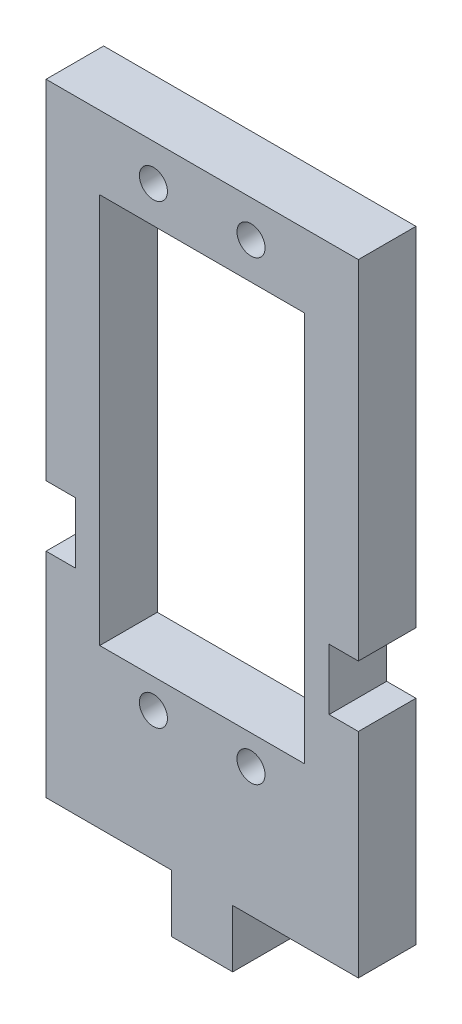
ISO-10303-21;
HEADER;
FILE_DESCRIPTION(('STEP AP214'),'2;1');
FILE_NAME('part.step','',(''),(''),'','','');
FILE_SCHEMA(('AUTOMOTIVE_DESIGN { 1 0 10303 214 1 1 1 1 }'));
ENDSEC;
DATA;
#1=APPLICATION_CONTEXT('core data for automotive mechanical design processes');
#2=APPLICATION_PROTOCOL_DEFINITION('international standard','automotive_design',2000,#1);
#3=PRODUCT_CONTEXT('',#1,'mechanical');
#4=PRODUCT('Part','Part','',(#3));
#5=PRODUCT_RELATED_PRODUCT_CATEGORY('part','',(#4));
#6=PRODUCT_DEFINITION_FORMATION('','',#4);
#7=PRODUCT_DEFINITION_CONTEXT('part definition',#1,'design');
#8=PRODUCT_DEFINITION('design','',#6,#7);
#9=PRODUCT_DEFINITION_SHAPE('','',#8);
#10=(LENGTH_UNIT() NAMED_UNIT(*) SI_UNIT(.MILLI.,.METRE.));
#11=(NAMED_UNIT(*) PLANE_ANGLE_UNIT() SI_UNIT($,.RADIAN.));
#12=(NAMED_UNIT(*) SI_UNIT($,.STERADIAN.) SOLID_ANGLE_UNIT());
#13=UNCERTAINTY_MEASURE_WITH_UNIT(LENGTH_MEASURE(1.E-05),#10,'distance_accuracy_value','');
#14=(GEOMETRIC_REPRESENTATION_CONTEXT(3) GLOBAL_UNCERTAINTY_ASSIGNED_CONTEXT((#13)) GLOBAL_UNIT_ASSIGNED_CONTEXT((#10,
#11,#12)) REPRESENTATION_CONTEXT('',''));
#15=CARTESIAN_POINT('',(0.,0.,0.));
#16=DIRECTION('',(0.,0.,1.));
#17=DIRECTION('',(1.,0.,0.));
#18=AXIS2_PLACEMENT_3D('',#15,#16,#17);
#19=CARTESIAN_POINT('',(0.,0.,5.9944));
#20=DIRECTION('',(0.,0.,1.));
#21=DIRECTION('',(1.,0.,0.));
#22=AXIS2_PLACEMENT_3D('',#19,#20,#21);
#23=PLANE('',#22);
#24=CARTESIAN_POINT('',(-5.08,13.462,5.9944));
#25=DIRECTION('',(0.,0.,1.));
#26=DIRECTION('',(-1.,0.,0.));
#27=AXIS2_PLACEMENT_3D('',#24,#25,#26);
#28=CIRCLE('',#27,1.4605);
#29=CARTESIAN_POINT('',(-6.5405,13.462,5.9944));
#30=VERTEX_POINT('',#29);
#31=EDGE_CURVE('E629',#30,#30,#28,.T.);
#32=ORIENTED_EDGE('',*,*,#31,.F.);
#33=EDGE_LOOP('',(#32));
#34=FACE_BOUND('',#33,.T.);
#35=CARTESIAN_POINT('',(5.08,60.96,5.9944));
#36=DIRECTION('',(0.,0.,1.));
#37=DIRECTION('',(1.,0.,0.));
#38=AXIS2_PLACEMENT_3D('',#35,#36,#37);
#39=CIRCLE('',#38,1.4605);
#40=CARTESIAN_POINT('',(6.5405,60.96,5.9944));
#41=VERTEX_POINT('',#40);
#42=EDGE_CURVE('E199',#41,#41,#39,.T.);
#43=ORIENTED_EDGE('',*,*,#42,.F.);
#44=EDGE_LOOP('',(#43));
#45=FACE_BOUND('',#44,.T.);
#46=DIRECTION('',(0.,-1.,0.));
#47=VECTOR('',#46,1.);
#48=CARTESIAN_POINT('',(-16.256,28.575,5.9944));
#49=LINE('',#48,#47);
#50=CARTESIAN_POINT('',(-16.256,64.77,5.9944));
#51=VERTEX_POINT('',#50);
#52=CARTESIAN_POINT('',(-16.256,28.575,5.9944));
#53=VERTEX_POINT('',#52);
#54=EDGE_CURVE('E209',#51,#53,#49,.T.);
#55=ORIENTED_EDGE('',*,*,#54,.T.);
#56=DIRECTION('',(1.,0.,0.));
#57=VECTOR('',#56,1.);
#58=CARTESIAN_POINT('',(-16.256,28.575,5.9944));
#59=LINE('',#58,#57);
#60=CARTESIAN_POINT('',(-13.208,28.575,5.9944));
#61=VERTEX_POINT('',#60);
#62=EDGE_CURVE('E212',#53,#61,#59,.T.);
#63=ORIENTED_EDGE('',*,*,#62,.T.);
#64=DIRECTION('',(0.,-1.,0.));
#65=VECTOR('',#64,1.);
#66=CARTESIAN_POINT('',(-13.208,28.575,5.9944));
#67=LINE('',#66,#65);
#68=CARTESIAN_POINT('',(-13.208,22.225,5.9944));
#69=VERTEX_POINT('',#68);
#70=EDGE_CURVE('E215',#61,#69,#67,.T.);
#71=ORIENTED_EDGE('',*,*,#70,.T.);
#72=DIRECTION('',(-1.,0.,0.));
#73=VECTOR('',#72,1.);
#74=CARTESIAN_POINT('',(-13.208,22.225,5.9944));
#75=LINE('',#74,#73);
#76=CARTESIAN_POINT('',(-16.256,22.225,5.9944));
#77=VERTEX_POINT('',#76);
#78=EDGE_CURVE('E217',#69,#77,#75,.T.);
#79=ORIENTED_EDGE('',*,*,#78,.T.);
#80=DIRECTION('',(0.,-1.,0.));
#81=VECTOR('',#80,1.);
#82=CARTESIAN_POINT('',(-16.256,0.,5.9944));
#83=LINE('',#82,#81);
#84=CARTESIAN_POINT('',(-16.256,0.,5.9944));
#85=VERTEX_POINT('',#84);
#86=EDGE_CURVE('E219',#77,#85,#83,.T.);
#87=ORIENTED_EDGE('',*,*,#86,.T.);
#88=DIRECTION('',(1.,0.,0.));
#89=VECTOR('',#88,1.);
#90=CARTESIAN_POINT('',(-3.175,0.,5.9944));
#91=LINE('',#90,#89);
#92=CARTESIAN_POINT('',(-3.175,0.,5.9944));
#93=VERTEX_POINT('',#92);
#94=EDGE_CURVE('E221',#85,#93,#91,.T.);
#95=ORIENTED_EDGE('',*,*,#94,.T.);
#96=DIRECTION('',(0.,-1.,0.));
#97=VECTOR('',#96,1.);
#98=CARTESIAN_POINT('',(-3.175,-5.9944,5.9944));
#99=LINE('',#98,#97);
#100=CARTESIAN_POINT('',(-3.175,-5.9944,5.9944));
#101=VERTEX_POINT('',#100);
#102=EDGE_CURVE('E223',#93,#101,#99,.T.);
#103=ORIENTED_EDGE('',*,*,#102,.T.);
#104=DIRECTION('',(1.,0.,0.));
#105=VECTOR('',#104,1.);
#106=CARTESIAN_POINT('',(-3.175,-5.9944,5.9944));
#107=LINE('',#106,#105);
#108=CARTESIAN_POINT('',(3.175,-5.9944,5.9944));
#109=VERTEX_POINT('',#108);
#110=EDGE_CURVE('E225',#101,#109,#107,.T.);
#111=ORIENTED_EDGE('',*,*,#110,.T.);
#112=DIRECTION('',(0.,1.,0.));
#113=VECTOR('',#112,1.);
#114=CARTESIAN_POINT('',(3.175,-5.9944,5.9944));
#115=LINE('',#114,#113);
#116=CARTESIAN_POINT('',(3.175,0.,5.9944));
#117=VERTEX_POINT('',#116);
#118=EDGE_CURVE('E227',#109,#117,#115,.T.);
#119=ORIENTED_EDGE('',*,*,#118,.T.);
#120=DIRECTION('',(1.,0.,0.));
#121=VECTOR('',#120,1.);
#122=CARTESIAN_POINT('',(3.175,0.,5.9944));
#123=LINE('',#122,#121);
#124=CARTESIAN_POINT('',(16.256,0.,5.9944));
#125=VERTEX_POINT('',#124);
#126=EDGE_CURVE('E229',#117,#125,#123,.T.);
#127=ORIENTED_EDGE('',*,*,#126,.T.);
#128=DIRECTION('',(0.,1.,0.));
#129=VECTOR('',#128,1.);
#130=CARTESIAN_POINT('',(16.256,0.,5.9944));
#131=LINE('',#130,#129);
#132=CARTESIAN_POINT('',(16.256,22.225,5.9944));
#133=VERTEX_POINT('',#132);
#134=EDGE_CURVE('E231',#125,#133,#131,.T.);
#135=ORIENTED_EDGE('',*,*,#134,.T.);
#136=DIRECTION('',(-1.,0.,0.));
#137=VECTOR('',#136,1.);
#138=CARTESIAN_POINT('',(13.208,22.225,5.9944));
#139=LINE('',#138,#137);
#140=CARTESIAN_POINT('',(13.208,22.225,5.9944));
#141=VERTEX_POINT('',#140);
#142=EDGE_CURVE('E233',#133,#141,#139,.T.);
#143=ORIENTED_EDGE('',*,*,#142,.T.);
#144=DIRECTION('',(0.,1.,0.));
#145=VECTOR('',#144,1.);
#146=CARTESIAN_POINT('',(13.208,28.575,5.9944));
#147=LINE('',#146,#145);
#148=CARTESIAN_POINT('',(13.208,28.575,5.9944));
#149=VERTEX_POINT('',#148);
#150=EDGE_CURVE('E235',#141,#149,#147,.T.);
#151=ORIENTED_EDGE('',*,*,#150,.T.);
#152=DIRECTION('',(1.,0.,0.));
#153=VECTOR('',#152,1.);
#154=CARTESIAN_POINT('',(16.256,28.575,5.9944));
#155=LINE('',#154,#153);
#156=CARTESIAN_POINT('',(16.256,28.575,5.9944));
#157=VERTEX_POINT('',#156);
#158=EDGE_CURVE('E237',#149,#157,#155,.T.);
#159=ORIENTED_EDGE('',*,*,#158,.T.);
#160=DIRECTION('',(0.,1.,0.));
#161=VECTOR('',#160,1.);
#162=CARTESIAN_POINT('',(16.256,28.575,5.9944));
#163=LINE('',#162,#161);
#164=CARTESIAN_POINT('',(16.256,64.77,5.9944));
#165=VERTEX_POINT('',#164);
#166=EDGE_CURVE('E239',#157,#165,#163,.T.);
#167=ORIENTED_EDGE('',*,*,#166,.T.);
#168=DIRECTION('',(-1.,0.,0.));
#169=VECTOR('',#168,1.);
#170=CARTESIAN_POINT('',(16.256,64.77,5.9944));
#171=LINE('',#170,#169);
#172=EDGE_CURVE('E241',#165,#51,#171,.T.);
#173=ORIENTED_EDGE('',*,*,#172,.T.);
#174=EDGE_LOOP('',(#55,#63,#71,#79,#87,#95,#103,#111,#119,#127,#135,#143,#151,#159,#167,#173));
#175=FACE_BOUND('',#174,.T.);
#176=DIRECTION('',(-1.,0.,0.));
#177=VECTOR('',#176,1.);
#178=CARTESIAN_POINT('',(10.668,57.15,5.9944));
#179=LINE('',#178,#177);
#180=CARTESIAN_POINT('',(10.668,57.15,5.9944));
#181=VERTEX_POINT('',#180);
#182=CARTESIAN_POINT('',(-10.668,57.15,5.9944));
#183=VERTEX_POINT('',#182);
#184=EDGE_CURVE('E178',#181,#183,#179,.T.);
#185=ORIENTED_EDGE('',*,*,#184,.F.);
#186=DIRECTION('',(0.,1.,0.));
#187=VECTOR('',#186,1.);
#188=CARTESIAN_POINT('',(10.668,16.51,5.9944));
#189=LINE('',#188,#187);
#190=CARTESIAN_POINT('',(10.668,16.51,5.9944));
#191=VERTEX_POINT('',#190);
#192=EDGE_CURVE('E170',#191,#181,#189,.T.);
#193=ORIENTED_EDGE('',*,*,#192,.F.);
#194=DIRECTION('',(1.,0.,0.));
#195=VECTOR('',#194,1.);
#196=CARTESIAN_POINT('',(-10.668,16.51,5.9944));
#197=LINE('',#196,#195);
#198=CARTESIAN_POINT('',(-10.668,16.51,5.9944));
#199=VERTEX_POINT('',#198);
#200=EDGE_CURVE('E193',#199,#191,#197,.T.);
#201=ORIENTED_EDGE('',*,*,#200,.F.);
#202=DIRECTION('',(0.,-1.,0.));
#203=VECTOR('',#202,1.);
#204=CARTESIAN_POINT('',(-10.668,16.51,5.9944));
#205=LINE('',#204,#203);
#206=EDGE_CURVE('E191',#183,#199,#205,.T.);
#207=ORIENTED_EDGE('',*,*,#206,.F.);
#208=EDGE_LOOP('',(#185,#193,#201,#207));
#209=FACE_BOUND('',#208,.T.);
#210=CARTESIAN_POINT('',(5.08,13.462,5.9944));
#211=DIRECTION('',(0.,0.,1.));
#212=DIRECTION('',(1.,0.,0.));
#213=AXIS2_PLACEMENT_3D('',#210,#211,#212);
#214=CIRCLE('',#213,1.4605);
#215=CARTESIAN_POINT('',(6.5405,13.462,5.9944));
#216=VERTEX_POINT('',#215);
#217=EDGE_CURVE('E635',#216,#216,#214,.T.);
#218=ORIENTED_EDGE('',*,*,#217,.F.);
#219=EDGE_LOOP('',(#218));
#220=FACE_BOUND('',#219,.T.);
#221=CARTESIAN_POINT('',(-5.08,60.96,5.9944));
#222=DIRECTION('',(0.,0.,1.));
#223=DIRECTION('',(-1.,0.,0.));
#224=AXIS2_PLACEMENT_3D('',#221,#222,#223);
#225=CIRCLE('',#224,1.4605);
#226=CARTESIAN_POINT('',(-6.5405,60.96,5.9944));
#227=VERTEX_POINT('',#226);
#228=EDGE_CURVE('E620',#227,#227,#225,.T.);
#229=ORIENTED_EDGE('',*,*,#228,.F.);
#230=EDGE_LOOP('',(#229));
#231=FACE_BOUND('',#230,.T.);
#232=ADVANCED_FACE('F33',(#34,#45,#175,#209,#220,#231),#23,.T.);
#233=CARTESIAN_POINT('',(0.,0.,0.));
#234=DIRECTION('',(0.,0.,1.));
#235=DIRECTION('',(1.,0.,0.));
#236=AXIS2_PLACEMENT_3D('',#233,#234,#235);
#237=PLANE('',#236);
#238=DIRECTION('',(0.,-1.,0.));
#239=VECTOR('',#238,1.);
#240=CARTESIAN_POINT('',(-16.256,28.575,0.));
#241=LINE('',#240,#239);
#242=CARTESIAN_POINT('',(-16.256,64.77,0.));
#243=VERTEX_POINT('',#242);
#244=CARTESIAN_POINT('',(-16.256,28.575,0.));
#245=VERTEX_POINT('',#244);
#246=EDGE_CURVE('E186',#243,#245,#241,.T.);
#247=ORIENTED_EDGE('',*,*,#246,.F.);
#248=DIRECTION('',(-1.,0.,0.));
#249=VECTOR('',#248,1.);
#250=CARTESIAN_POINT('',(16.256,64.77,0.));
#251=LINE('',#250,#249);
#252=CARTESIAN_POINT('',(16.256,64.77,0.));
#253=VERTEX_POINT('',#252);
#254=EDGE_CURVE('E213',#253,#243,#251,.T.);
#255=ORIENTED_EDGE('',*,*,#254,.F.);
#256=DIRECTION('',(0.,1.,0.));
#257=VECTOR('',#256,1.);
#258=CARTESIAN_POINT('',(16.256,28.575,0.));
#259=LINE('',#258,#257);
#260=CARTESIAN_POINT('',(16.256,28.575,0.));
#261=VERTEX_POINT('',#260);
#262=EDGE_CURVE('E272',#261,#253,#259,.T.);
#263=ORIENTED_EDGE('',*,*,#262,.F.);
#264=DIRECTION('',(1.,0.,0.));
#265=VECTOR('',#264,1.);
#266=CARTESIAN_POINT('',(16.256,28.575,0.));
#267=LINE('',#266,#265);
#268=CARTESIAN_POINT('',(13.208,28.575,0.));
#269=VERTEX_POINT('',#268);
#270=EDGE_CURVE('E270',#269,#261,#267,.T.);
#271=ORIENTED_EDGE('',*,*,#270,.F.);
#272=DIRECTION('',(0.,1.,0.));
#273=VECTOR('',#272,1.);
#274=CARTESIAN_POINT('',(13.208,28.575,0.));
#275=LINE('',#274,#273);
#276=CARTESIAN_POINT('',(13.208,22.225,0.));
#277=VERTEX_POINT('',#276);
#278=EDGE_CURVE('E268',#277,#269,#275,.T.);
#279=ORIENTED_EDGE('',*,*,#278,.F.);
#280=DIRECTION('',(-1.,0.,0.));
#281=VECTOR('',#280,1.);
#282=CARTESIAN_POINT('',(13.208,22.225,0.));
#283=LINE('',#282,#281);
#284=CARTESIAN_POINT('',(16.256,22.225,0.));
#285=VERTEX_POINT('',#284);
#286=EDGE_CURVE('E266',#285,#277,#283,.T.);
#287=ORIENTED_EDGE('',*,*,#286,.F.);
#288=DIRECTION('',(0.,1.,0.));
#289=VECTOR('',#288,1.);
#290=CARTESIAN_POINT('',(16.256,0.,0.));
#291=LINE('',#290,#289);
#292=CARTESIAN_POINT('',(16.256,0.,0.));
#293=VERTEX_POINT('',#292);
#294=EDGE_CURVE('E264',#293,#285,#291,.T.);
#295=ORIENTED_EDGE('',*,*,#294,.F.);
#296=DIRECTION('',(1.,0.,0.));
#297=VECTOR('',#296,1.);
#298=CARTESIAN_POINT('',(3.175,0.,0.));
#299=LINE('',#298,#297);
#300=CARTESIAN_POINT('',(3.175,0.,0.));
#301=VERTEX_POINT('',#300);
#302=EDGE_CURVE('E262',#301,#293,#299,.T.);
#303=ORIENTED_EDGE('',*,*,#302,.F.);
#304=DIRECTION('',(0.,1.,0.));
#305=VECTOR('',#304,1.);
#306=CARTESIAN_POINT('',(3.175,-5.9944,0.));
#307=LINE('',#306,#305);
#308=CARTESIAN_POINT('',(3.175,-5.9944,0.));
#309=VERTEX_POINT('',#308);
#310=EDGE_CURVE('E260',#309,#301,#307,.T.);
#311=ORIENTED_EDGE('',*,*,#310,.F.);
#312=DIRECTION('',(1.,0.,0.));
#313=VECTOR('',#312,1.);
#314=CARTESIAN_POINT('',(-3.175,-5.9944,0.));
#315=LINE('',#314,#313);
#316=CARTESIAN_POINT('',(-3.175,-5.9944,0.));
#317=VERTEX_POINT('',#316);
#318=EDGE_CURVE('E258',#317,#309,#315,.T.);
#319=ORIENTED_EDGE('',*,*,#318,.F.);
#320=DIRECTION('',(0.,-1.,0.));
#321=VECTOR('',#320,1.);
#322=CARTESIAN_POINT('',(-3.175,-5.9944,0.));
#323=LINE('',#322,#321);
#324=CARTESIAN_POINT('',(-3.175,0.,0.));
#325=VERTEX_POINT('',#324);
#326=EDGE_CURVE('E256',#325,#317,#323,.T.);
#327=ORIENTED_EDGE('',*,*,#326,.F.);
#328=DIRECTION('',(1.,0.,0.));
#329=VECTOR('',#328,1.);
#330=CARTESIAN_POINT('',(-3.175,0.,0.));
#331=LINE('',#330,#329);
#332=CARTESIAN_POINT('',(-16.256,0.,0.));
#333=VERTEX_POINT('',#332);
#334=EDGE_CURVE('E254',#333,#325,#331,.T.);
#335=ORIENTED_EDGE('',*,*,#334,.F.);
#336=DIRECTION('',(0.,-1.,0.));
#337=VECTOR('',#336,1.);
#338=CARTESIAN_POINT('',(-16.256,0.,0.));
#339=LINE('',#338,#337);
#340=CARTESIAN_POINT('',(-16.256,22.225,0.));
#341=VERTEX_POINT('',#340);
#342=EDGE_CURVE('E252',#341,#333,#339,.T.);
#343=ORIENTED_EDGE('',*,*,#342,.F.);
#344=DIRECTION('',(-1.,0.,0.));
#345=VECTOR('',#344,1.);
#346=CARTESIAN_POINT('',(-13.208,22.225,0.));
#347=LINE('',#346,#345);
#348=CARTESIAN_POINT('',(-13.208,22.225,0.));
#349=VERTEX_POINT('',#348);
#350=EDGE_CURVE('E250',#349,#341,#347,.T.);
#351=ORIENTED_EDGE('',*,*,#350,.F.);
#352=DIRECTION('',(0.,-1.,0.));
#353=VECTOR('',#352,1.);
#354=CARTESIAN_POINT('',(-13.208,28.575,0.));
#355=LINE('',#354,#353);
#356=CARTESIAN_POINT('',(-13.208,28.575,0.));
#357=VERTEX_POINT('',#356);
#358=EDGE_CURVE('E248',#357,#349,#355,.T.);
#359=ORIENTED_EDGE('',*,*,#358,.F.);
#360=DIRECTION('',(1.,0.,0.));
#361=VECTOR('',#360,1.);
#362=CARTESIAN_POINT('',(-16.256,28.575,0.));
#363=LINE('',#362,#361);
#364=EDGE_CURVE('E246',#245,#357,#363,.T.);
#365=ORIENTED_EDGE('',*,*,#364,.F.);
#366=EDGE_LOOP('',(#247,#255,#263,#271,#279,#287,#295,#303,#311,#319,#327,#335,#343,#351,#359,#365));
#367=FACE_BOUND('',#366,.T.);
#368=DIRECTION('',(0.,1.,0.));
#369=VECTOR('',#368,1.);
#370=CARTESIAN_POINT('',(10.668,16.51,0.));
#371=LINE('',#370,#369);
#372=CARTESIAN_POINT('',(10.668,16.51,0.));
#373=VERTEX_POINT('',#372);
#374=CARTESIAN_POINT('',(10.668,57.15,0.));
#375=VERTEX_POINT('',#374);
#376=EDGE_CURVE('E56',#373,#375,#371,.T.);
#377=ORIENTED_EDGE('',*,*,#376,.T.);
#378=DIRECTION('',(-1.,0.,0.));
#379=VECTOR('',#378,1.);
#380=CARTESIAN_POINT('',(10.668,57.15,0.));
#381=LINE('',#380,#379);
#382=CARTESIAN_POINT('',(-10.668,57.15,0.));
#383=VERTEX_POINT('',#382);
#384=EDGE_CURVE('E185',#375,#383,#381,.T.);
#385=ORIENTED_EDGE('',*,*,#384,.T.);
#386=DIRECTION('',(0.,-1.,0.));
#387=VECTOR('',#386,1.);
#388=CARTESIAN_POINT('',(-10.668,16.51,0.));
#389=LINE('',#388,#387);
#390=CARTESIAN_POINT('',(-10.668,16.51,0.));
#391=VERTEX_POINT('',#390);
#392=EDGE_CURVE('E201',#383,#391,#389,.T.);
#393=ORIENTED_EDGE('',*,*,#392,.T.);
#394=DIRECTION('',(1.,0.,0.));
#395=VECTOR('',#394,1.);
#396=CARTESIAN_POINT('',(-10.668,16.51,0.));
#397=LINE('',#396,#395);
#398=EDGE_CURVE('E179',#391,#373,#397,.T.);
#399=ORIENTED_EDGE('',*,*,#398,.T.);
#400=EDGE_LOOP('',(#377,#385,#393,#399));
#401=FACE_BOUND('',#400,.T.);
#402=CARTESIAN_POINT('',(5.08,60.96,0.));
#403=DIRECTION('',(0.,0.,1.));
#404=DIRECTION('',(1.,0.,0.));
#405=AXIS2_PLACEMENT_3D('',#402,#403,#404);
#406=CIRCLE('',#405,1.4605);
#407=CARTESIAN_POINT('',(6.5405,60.96,0.));
#408=VERTEX_POINT('',#407);
#409=EDGE_CURVE('E638',#408,#408,#406,.T.);
#410=ORIENTED_EDGE('',*,*,#409,.T.);
#411=EDGE_LOOP('',(#410));
#412=FACE_BOUND('',#411,.T.);
#413=CARTESIAN_POINT('',(5.08,13.462,0.));
#414=DIRECTION('',(0.,0.,1.));
#415=DIRECTION('',(1.,0.,0.));
#416=AXIS2_PLACEMENT_3D('',#413,#414,#415);
#417=CIRCLE('',#416,1.4605);
#418=CARTESIAN_POINT('',(6.5405,13.462,0.));
#419=VERTEX_POINT('',#418);
#420=EDGE_CURVE('E632',#419,#419,#417,.T.);
#421=ORIENTED_EDGE('',*,*,#420,.T.);
#422=EDGE_LOOP('',(#421));
#423=FACE_BOUND('',#422,.T.);
#424=CARTESIAN_POINT('',(-5.08,13.462,0.));
#425=DIRECTION('',(0.,0.,1.));
#426=DIRECTION('',(-1.,0.,0.));
#427=AXIS2_PLACEMENT_3D('',#424,#425,#426);
#428=CIRCLE('',#427,1.4605);
#429=CARTESIAN_POINT('',(-6.5405,13.462,0.));
#430=VERTEX_POINT('',#429);
#431=EDGE_CURVE('E626',#430,#430,#428,.T.);
#432=ORIENTED_EDGE('',*,*,#431,.T.);
#433=EDGE_LOOP('',(#432));
#434=FACE_BOUND('',#433,.T.);
#435=CARTESIAN_POINT('',(-5.08,60.96,0.));
#436=DIRECTION('',(0.,0.,1.));
#437=DIRECTION('',(-1.,0.,0.));
#438=AXIS2_PLACEMENT_3D('',#435,#436,#437);
#439=CIRCLE('',#438,1.4605);
#440=CARTESIAN_POINT('',(-6.5405,60.96,0.));
#441=VERTEX_POINT('',#440);
#442=EDGE_CURVE('E623',#441,#441,#439,.T.);
#443=ORIENTED_EDGE('',*,*,#442,.T.);
#444=EDGE_LOOP('',(#443));
#445=FACE_BOUND('',#444,.T.);
#446=ADVANCED_FACE('F326',(#367,#401,#412,#423,#434,#445),#237,.F.);
#447=CARTESIAN_POINT('',(-16.256,28.575,5.9944));
#448=DIRECTION('',(1.,0.,0.));
#449=DIRECTION('',(0.,1.,0.));
#450=AXIS2_PLACEMENT_3D('',#447,#448,#449);
#451=PLANE('',#450);
#452=ORIENTED_EDGE('',*,*,#246,.T.);
#453=DIRECTION('',(0.,0.,-1.));
#454=VECTOR('',#453,1.);
#455=CARTESIAN_POINT('',(-16.256,28.575,5.9944));
#456=LINE('',#455,#454);
#457=EDGE_CURVE('E11',#53,#245,#456,.T.);
#458=ORIENTED_EDGE('',*,*,#457,.F.);
#459=ORIENTED_EDGE('',*,*,#54,.F.);
#460=DIRECTION('',(0.,0.,-1.));
#461=VECTOR('',#460,1.);
#462=CARTESIAN_POINT('',(-16.256,64.77,5.9944));
#463=LINE('',#462,#461);
#464=EDGE_CURVE('E243',#51,#243,#463,.T.);
#465=ORIENTED_EDGE('',*,*,#464,.T.);
#466=EDGE_LOOP('',(#452,#458,#459,#465));
#467=FACE_BOUND('',#466,.T.);
#468=ADVANCED_FACE('F35',(#467),#451,.F.);
#469=CARTESIAN_POINT('',(-16.256,28.575,5.9944));
#470=DIRECTION('',(0.,1.,0.));
#471=DIRECTION('',(0.,0.,1.));
#472=AXIS2_PLACEMENT_3D('',#469,#470,#471);
#473=PLANE('',#472);
#474=ORIENTED_EDGE('',*,*,#364,.T.);
#475=DIRECTION('',(0.,0.,-1.));
#476=VECTOR('',#475,1.);
#477=CARTESIAN_POINT('',(-13.208,28.575,5.9944));
#478=LINE('',#477,#476);
#479=EDGE_CURVE('E41',#61,#357,#478,.T.);
#480=ORIENTED_EDGE('',*,*,#479,.F.);
#481=ORIENTED_EDGE('',*,*,#62,.F.);
#482=ORIENTED_EDGE('',*,*,#457,.T.);
#483=EDGE_LOOP('',(#474,#480,#481,#482));
#484=FACE_BOUND('',#483,.T.);
#485=ADVANCED_FACE('F343',(#484),#473,.F.);
#486=CARTESIAN_POINT('',(-13.208,28.575,5.9944));
#487=DIRECTION('',(1.,0.,0.));
#488=DIRECTION('',(0.,0.,-1.));
#489=AXIS2_PLACEMENT_3D('',#486,#487,#488);
#490=PLANE('',#489);
#491=ORIENTED_EDGE('',*,*,#358,.T.);
#492=DIRECTION('',(0.,0.,-1.));
#493=VECTOR('',#492,1.);
#494=CARTESIAN_POINT('',(-13.208,22.225,5.9944));
#495=LINE('',#494,#493);
#496=EDGE_CURVE('E313',#69,#349,#495,.T.);
#497=ORIENTED_EDGE('',*,*,#496,.F.);
#498=ORIENTED_EDGE('',*,*,#70,.F.);
#499=ORIENTED_EDGE('',*,*,#479,.T.);
#500=EDGE_LOOP('',(#491,#497,#498,#499));
#501=FACE_BOUND('',#500,.T.);
#502=ADVANCED_FACE('F320',(#501),#490,.F.);
#503=CARTESIAN_POINT('',(-13.208,22.225,5.9944));
#504=DIRECTION('',(0.,-1.,0.));
#505=DIRECTION('',(0.,0.,-1.));
#506=AXIS2_PLACEMENT_3D('',#503,#504,#505);
#507=PLANE('',#506);
#508=ORIENTED_EDGE('',*,*,#350,.T.);
#509=DIRECTION('',(0.,0.,-1.));
#510=VECTOR('',#509,1.);
#511=CARTESIAN_POINT('',(-16.256,22.225,5.9944));
#512=LINE('',#511,#510);
#513=EDGE_CURVE('E310',#77,#341,#512,.T.);
#514=ORIENTED_EDGE('',*,*,#513,.F.);
#515=ORIENTED_EDGE('',*,*,#78,.F.);
#516=ORIENTED_EDGE('',*,*,#496,.T.);
#517=EDGE_LOOP('',(#508,#514,#515,#516));
#518=FACE_BOUND('',#517,.T.);
#519=ADVANCED_FACE('F332',(#518),#507,.F.);
#520=CARTESIAN_POINT('',(-16.256,0.,5.9944));
#521=DIRECTION('',(1.,0.,0.));
#522=DIRECTION('',(0.,1.,0.));
#523=AXIS2_PLACEMENT_3D('',#520,#521,#522);
#524=PLANE('',#523);
#525=ORIENTED_EDGE('',*,*,#342,.T.);
#526=DIRECTION('',(0.,0.,-1.));
#527=VECTOR('',#526,1.);
#528=CARTESIAN_POINT('',(-16.256,0.,5.9944));
#529=LINE('',#528,#527);
#530=EDGE_CURVE('E307',#85,#333,#529,.T.);
#531=ORIENTED_EDGE('',*,*,#530,.F.);
#532=ORIENTED_EDGE('',*,*,#86,.F.);
#533=ORIENTED_EDGE('',*,*,#513,.T.);
#534=EDGE_LOOP('',(#525,#531,#532,#533));
#535=FACE_BOUND('',#534,.T.);
#536=ADVANCED_FACE('F336',(#535),#524,.F.);
#537=CARTESIAN_POINT('',(-3.175,0.,5.9944));
#538=DIRECTION('',(0.,1.,0.));
#539=DIRECTION('',(-1.,0.,0.));
#540=AXIS2_PLACEMENT_3D('',#537,#538,#539);
#541=PLANE('',#540);
#542=ORIENTED_EDGE('',*,*,#334,.T.);
#543=DIRECTION('',(0.,0.,-1.));
#544=VECTOR('',#543,1.);
#545=CARTESIAN_POINT('',(-3.175,0.,5.9944));
#546=LINE('',#545,#544);
#547=EDGE_CURVE('E304',#93,#325,#546,.T.);
#548=ORIENTED_EDGE('',*,*,#547,.F.);
#549=ORIENTED_EDGE('',*,*,#94,.F.);
#550=ORIENTED_EDGE('',*,*,#530,.T.);
#551=EDGE_LOOP('',(#542,#548,#549,#550));
#552=FACE_BOUND('',#551,.T.);
#553=ADVANCED_FACE('F396',(#552),#541,.F.);
#554=CARTESIAN_POINT('',(-3.175,-5.9944,5.9944));
#555=DIRECTION('',(1.,0.,0.));
#556=DIRECTION('',(0.,0.,-1.));
#557=AXIS2_PLACEMENT_3D('',#554,#555,#556);
#558=PLANE('',#557);
#559=ORIENTED_EDGE('',*,*,#326,.T.);
#560=DIRECTION('',(0.,0.,-1.));
#561=VECTOR('',#560,1.);
#562=CARTESIAN_POINT('',(-3.175,-5.9944,5.9944));
#563=LINE('',#562,#561);
#564=EDGE_CURVE('E301',#101,#317,#563,.T.);
#565=ORIENTED_EDGE('',*,*,#564,.F.);
#566=ORIENTED_EDGE('',*,*,#102,.F.);
#567=ORIENTED_EDGE('',*,*,#547,.T.);
#568=EDGE_LOOP('',(#559,#565,#566,#567));
#569=FACE_BOUND('',#568,.T.);
#570=ADVANCED_FACE('F393',(#569),#558,.F.);
#571=CARTESIAN_POINT('',(-3.175,-5.9944,5.9944));
#572=DIRECTION('',(0.,1.,0.));
#573=DIRECTION('',(0.,0.,1.));
#574=AXIS2_PLACEMENT_3D('',#571,#572,#573);
#575=PLANE('',#574);
#576=ORIENTED_EDGE('',*,*,#318,.T.);
#577=DIRECTION('',(0.,0.,-1.));
#578=VECTOR('',#577,1.);
#579=CARTESIAN_POINT('',(3.175,-5.9944,5.9944));
#580=LINE('',#579,#578);
#581=EDGE_CURVE('E298',#109,#309,#580,.T.);
#582=ORIENTED_EDGE('',*,*,#581,.F.);
#583=ORIENTED_EDGE('',*,*,#110,.F.);
#584=ORIENTED_EDGE('',*,*,#564,.T.);
#585=EDGE_LOOP('',(#576,#582,#583,#584));
#586=FACE_BOUND('',#585,.T.);
#587=ADVANCED_FACE('F389',(#586),#575,.F.);
#588=CARTESIAN_POINT('',(3.175,-5.9944,5.9944));
#589=DIRECTION('',(-1.,0.,0.));
#590=DIRECTION('',(0.,0.,1.));
#591=AXIS2_PLACEMENT_3D('',#588,#589,#590);
#592=PLANE('',#591);
#593=ORIENTED_EDGE('',*,*,#310,.T.);
#594=DIRECTION('',(0.,0.,-1.));
#595=VECTOR('',#594,1.);
#596=CARTESIAN_POINT('',(3.175,0.,5.9944));
#597=LINE('',#596,#595);
#598=EDGE_CURVE('E295',#117,#301,#597,.T.);
#599=ORIENTED_EDGE('',*,*,#598,.F.);
#600=ORIENTED_EDGE('',*,*,#118,.F.);
#601=ORIENTED_EDGE('',*,*,#581,.T.);
#602=EDGE_LOOP('',(#593,#599,#600,#601));
#603=FACE_BOUND('',#602,.T.);
#604=ADVANCED_FACE('F385',(#603),#592,.F.);
#605=CARTESIAN_POINT('',(3.175,0.,5.9944));
#606=DIRECTION('',(0.,1.,0.));
#607=DIRECTION('',(-1.,0.,0.));
#608=AXIS2_PLACEMENT_3D('',#605,#606,#607);
#609=PLANE('',#608);
#610=ORIENTED_EDGE('',*,*,#302,.T.);
#611=DIRECTION('',(0.,0.,-1.));
#612=VECTOR('',#611,1.);
#613=CARTESIAN_POINT('',(16.256,0.,5.9944));
#614=LINE('',#613,#612);
#615=EDGE_CURVE('E292',#125,#293,#614,.T.);
#616=ORIENTED_EDGE('',*,*,#615,.F.);
#617=ORIENTED_EDGE('',*,*,#126,.F.);
#618=ORIENTED_EDGE('',*,*,#598,.T.);
#619=EDGE_LOOP('',(#610,#616,#617,#618));
#620=FACE_BOUND('',#619,.T.);
#621=ADVANCED_FACE('F380',(#620),#609,.F.);
#622=CARTESIAN_POINT('',(16.256,0.,5.9944));
#623=DIRECTION('',(-1.,0.,0.));
#624=DIRECTION('',(0.,-1.,0.));
#625=AXIS2_PLACEMENT_3D('',#622,#623,#624);
#626=PLANE('',#625);
#627=ORIENTED_EDGE('',*,*,#294,.T.);
#628=DIRECTION('',(0.,0.,-1.));
#629=VECTOR('',#628,1.);
#630=CARTESIAN_POINT('',(16.256,22.225,5.9944));
#631=LINE('',#630,#629);
#632=EDGE_CURVE('E289',#133,#285,#631,.T.);
#633=ORIENTED_EDGE('',*,*,#632,.F.);
#634=ORIENTED_EDGE('',*,*,#134,.F.);
#635=ORIENTED_EDGE('',*,*,#615,.T.);
#636=EDGE_LOOP('',(#627,#633,#634,#635));
#637=FACE_BOUND('',#636,.T.);
#638=ADVANCED_FACE('F374',(#637),#626,.F.);
#639=CARTESIAN_POINT('',(13.208,22.225,5.9944));
#640=DIRECTION('',(0.,-1.,0.));
#641=DIRECTION('',(0.,0.,-1.));
#642=AXIS2_PLACEMENT_3D('',#639,#640,#641);
#643=PLANE('',#642);
#644=ORIENTED_EDGE('',*,*,#286,.T.);
#645=DIRECTION('',(0.,0.,-1.));
#646=VECTOR('',#645,1.);
#647=CARTESIAN_POINT('',(13.208,22.225,5.9944));
#648=LINE('',#647,#646);
#649=EDGE_CURVE('E286',#141,#277,#648,.T.);
#650=ORIENTED_EDGE('',*,*,#649,.F.);
#651=ORIENTED_EDGE('',*,*,#142,.F.);
#652=ORIENTED_EDGE('',*,*,#632,.T.);
#653=EDGE_LOOP('',(#644,#650,#651,#652));
#654=FACE_BOUND('',#653,.T.);
#655=ADVANCED_FACE('F370',(#654),#643,.F.);
#656=CARTESIAN_POINT('',(13.208,28.575,5.9944));
#657=DIRECTION('',(-1.,0.,0.));
#658=DIRECTION('',(0.,0.,1.));
#659=AXIS2_PLACEMENT_3D('',#656,#657,#658);
#660=PLANE('',#659);
#661=ORIENTED_EDGE('',*,*,#278,.T.);
#662=DIRECTION('',(0.,0.,-1.));
#663=VECTOR('',#662,1.);
#664=CARTESIAN_POINT('',(13.208,28.575,5.9944));
#665=LINE('',#664,#663);
#666=EDGE_CURVE('E283',#149,#269,#665,.T.);
#667=ORIENTED_EDGE('',*,*,#666,.F.);
#668=ORIENTED_EDGE('',*,*,#150,.F.);
#669=ORIENTED_EDGE('',*,*,#649,.T.);
#670=EDGE_LOOP('',(#661,#667,#668,#669));
#671=FACE_BOUND('',#670,.T.);
#672=ADVANCED_FACE('F365',(#671),#660,.F.);
#673=CARTESIAN_POINT('',(16.256,28.575,5.9944));
#674=DIRECTION('',(0.,1.,0.));
#675=DIRECTION('',(0.,0.,1.));
#676=AXIS2_PLACEMENT_3D('',#673,#674,#675);
#677=PLANE('',#676);
#678=ORIENTED_EDGE('',*,*,#270,.T.);
#679=DIRECTION('',(0.,0.,-1.));
#680=VECTOR('',#679,1.);
#681=CARTESIAN_POINT('',(16.256,28.575,5.9944));
#682=LINE('',#681,#680);
#683=EDGE_CURVE('E280',#157,#261,#682,.T.);
#684=ORIENTED_EDGE('',*,*,#683,.F.);
#685=ORIENTED_EDGE('',*,*,#158,.F.);
#686=ORIENTED_EDGE('',*,*,#666,.T.);
#687=EDGE_LOOP('',(#678,#684,#685,#686));
#688=FACE_BOUND('',#687,.T.);
#689=ADVANCED_FACE('F359',(#688),#677,.F.);
#690=CARTESIAN_POINT('',(16.256,28.575,5.9944));
#691=DIRECTION('',(-1.,0.,0.));
#692=DIRECTION('',(0.,-1.,0.));
#693=AXIS2_PLACEMENT_3D('',#690,#691,#692);
#694=PLANE('',#693);
#695=ORIENTED_EDGE('',*,*,#262,.T.);
#696=DIRECTION('',(0.,0.,-1.));
#697=VECTOR('',#696,1.);
#698=CARTESIAN_POINT('',(16.256,64.77,5.9944));
#699=LINE('',#698,#697);
#700=EDGE_CURVE('E277',#165,#253,#699,.T.);
#701=ORIENTED_EDGE('',*,*,#700,.F.);
#702=ORIENTED_EDGE('',*,*,#166,.F.);
#703=ORIENTED_EDGE('',*,*,#683,.T.);
#704=EDGE_LOOP('',(#695,#701,#702,#703));
#705=FACE_BOUND('',#704,.T.);
#706=ADVANCED_FACE('F355',(#705),#694,.F.);
#707=CARTESIAN_POINT('',(16.256,64.77,5.9944));
#708=DIRECTION('',(0.,-1.,0.));
#709=DIRECTION('',(0.,0.,-1.));
#710=AXIS2_PLACEMENT_3D('',#707,#708,#709);
#711=PLANE('',#710);
#712=ORIENTED_EDGE('',*,*,#254,.T.);
#713=ORIENTED_EDGE('',*,*,#464,.F.);
#714=ORIENTED_EDGE('',*,*,#172,.F.);
#715=ORIENTED_EDGE('',*,*,#700,.T.);
#716=EDGE_LOOP('',(#712,#713,#714,#715));
#717=FACE_BOUND('',#716,.T.);
#718=ADVANCED_FACE('F350',(#717),#711,.F.);
#719=CARTESIAN_POINT('',(10.668,16.51,5.9944));
#720=DIRECTION('',(-1.,0.,0.));
#721=DIRECTION('',(0.,0.,1.));
#722=AXIS2_PLACEMENT_3D('',#719,#720,#721);
#723=PLANE('',#722);
#724=ORIENTED_EDGE('',*,*,#376,.F.);
#725=DIRECTION('',(0.,0.,-1.));
#726=VECTOR('',#725,1.);
#727=CARTESIAN_POINT('',(10.668,16.51,5.9944));
#728=LINE('',#727,#726);
#729=EDGE_CURVE('E174',#191,#373,#728,.T.);
#730=ORIENTED_EDGE('',*,*,#729,.F.);
#731=ORIENTED_EDGE('',*,*,#192,.T.);
#732=DIRECTION('',(0.,0.,-1.));
#733=VECTOR('',#732,1.);
#734=CARTESIAN_POINT('',(10.668,57.15,5.9944));
#735=LINE('',#734,#733);
#736=EDGE_CURVE('E173',#181,#375,#735,.T.);
#737=ORIENTED_EDGE('',*,*,#736,.T.);
#738=EDGE_LOOP('',(#724,#730,#731,#737));
#739=FACE_BOUND('',#738,.T.);
#740=ADVANCED_FACE('F172',(#739),#723,.T.);
#741=CARTESIAN_POINT('',(10.668,57.15,5.9944));
#742=DIRECTION('',(0.,-1.,0.));
#743=DIRECTION('',(1.,0.,0.));
#744=AXIS2_PLACEMENT_3D('',#741,#742,#743);
#745=PLANE('',#744);
#746=ORIENTED_EDGE('',*,*,#384,.F.);
#747=ORIENTED_EDGE('',*,*,#736,.F.);
#748=ORIENTED_EDGE('',*,*,#184,.T.);
#749=DIRECTION('',(0.,0.,-1.));
#750=VECTOR('',#749,1.);
#751=CARTESIAN_POINT('',(-10.668,57.15,5.9944));
#752=LINE('',#751,#750);
#753=EDGE_CURVE('E187',#183,#383,#752,.T.);
#754=ORIENTED_EDGE('',*,*,#753,.T.);
#755=EDGE_LOOP('',(#746,#747,#748,#754));
#756=FACE_BOUND('',#755,.T.);
#757=ADVANCED_FACE('F182',(#756),#745,.T.);
#758=CARTESIAN_POINT('',(-10.668,16.51,5.9944));
#759=DIRECTION('',(1.,0.,0.));
#760=DIRECTION('',(0.,0.,-1.));
#761=AXIS2_PLACEMENT_3D('',#758,#759,#760);
#762=PLANE('',#761);
#763=ORIENTED_EDGE('',*,*,#392,.F.);
#764=ORIENTED_EDGE('',*,*,#753,.F.);
#765=ORIENTED_EDGE('',*,*,#206,.T.);
#766=DIRECTION('',(0.,0.,-1.));
#767=VECTOR('',#766,1.);
#768=CARTESIAN_POINT('',(-10.668,16.51,5.9944));
#769=LINE('',#768,#767);
#770=EDGE_CURVE('E48',#199,#391,#769,.T.);
#771=ORIENTED_EDGE('',*,*,#770,.T.);
#772=EDGE_LOOP('',(#763,#764,#765,#771));
#773=FACE_BOUND('',#772,.T.);
#774=ADVANCED_FACE('F481',(#773),#762,.T.);
#775=CARTESIAN_POINT('',(-10.668,16.51,5.9944));
#776=DIRECTION('',(0.,1.,0.));
#777=DIRECTION('',(0.,0.,1.));
#778=AXIS2_PLACEMENT_3D('',#775,#776,#777);
#779=PLANE('',#778);
#780=ORIENTED_EDGE('',*,*,#398,.F.);
#781=ORIENTED_EDGE('',*,*,#770,.F.);
#782=ORIENTED_EDGE('',*,*,#200,.T.);
#783=ORIENTED_EDGE('',*,*,#729,.T.);
#784=EDGE_LOOP('',(#780,#781,#782,#783));
#785=FACE_BOUND('',#784,.T.);
#786=ADVANCED_FACE('F487',(#785),#779,.T.);
#787=CARTESIAN_POINT('',(5.08,60.96,5.9944));
#788=DIRECTION('',(0.,0.,-1.));
#789=DIRECTION('',(-1.,0.,0.));
#790=AXIS2_PLACEMENT_3D('',#787,#788,#789);
#791=CYLINDRICAL_SURFACE('',#790,1.4605);
#792=ORIENTED_EDGE('',*,*,#42,.T.);
#793=EDGE_LOOP('',(#792));
#794=FACE_BOUND('',#793,.T.);
#795=ORIENTED_EDGE('',*,*,#409,.F.);
#796=EDGE_LOOP('',(#795));
#797=FACE_BOUND('',#796,.T.);
#798=ADVANCED_FACE('F495',(#794,#797),#791,.F.);
#799=CARTESIAN_POINT('',(5.08,13.462,5.9944));
#800=DIRECTION('',(0.,0.,-1.));
#801=DIRECTION('',(-1.,0.,0.));
#802=AXIS2_PLACEMENT_3D('',#799,#800,#801);
#803=CYLINDRICAL_SURFACE('',#802,1.4605);
#804=ORIENTED_EDGE('',*,*,#217,.T.);
#805=EDGE_LOOP('',(#804));
#806=FACE_BOUND('',#805,.T.);
#807=ORIENTED_EDGE('',*,*,#420,.F.);
#808=EDGE_LOOP('',(#807));
#809=FACE_BOUND('',#808,.T.);
#810=ADVANCED_FACE('F502',(#806,#809),#803,.F.);
#811=CARTESIAN_POINT('',(-5.08,13.462,5.9944));
#812=DIRECTION('',(0.,0.,-1.));
#813=DIRECTION('',(-1.,0.,0.));
#814=AXIS2_PLACEMENT_3D('',#811,#812,#813);
#815=CYLINDRICAL_SURFACE('',#814,1.4605);
#816=ORIENTED_EDGE('',*,*,#31,.T.);
#817=EDGE_LOOP('',(#816));
#818=FACE_BOUND('',#817,.T.);
#819=ORIENTED_EDGE('',*,*,#431,.F.);
#820=EDGE_LOOP('',(#819));
#821=FACE_BOUND('',#820,.T.);
#822=ADVANCED_FACE('F510',(#818,#821),#815,.F.);
#823=CARTESIAN_POINT('',(-5.08,60.96,5.9944));
#824=DIRECTION('',(0.,0.,-1.));
#825=DIRECTION('',(-1.,0.,0.));
#826=AXIS2_PLACEMENT_3D('',#823,#824,#825);
#827=CYLINDRICAL_SURFACE('',#826,1.4605);
#828=ORIENTED_EDGE('',*,*,#228,.T.);
#829=EDGE_LOOP('',(#828));
#830=FACE_BOUND('',#829,.T.);
#831=ORIENTED_EDGE('',*,*,#442,.F.);
#832=EDGE_LOOP('',(#831));
#833=FACE_BOUND('',#832,.T.);
#834=ADVANCED_FACE('F518',(#830,#833),#827,.F.);
#835=CLOSED_SHELL('',(#232,#446,#468,#485,#502,#519,#536,#553,#570,#587,#604,#621,#638,#655,
#672,#689,#706,#718,#740,#757,#774,#786,#798,#810,#822,#834));
#836=MANIFOLD_SOLID_BREP('B2',#835);
#837=ADVANCED_BREP_SHAPE_REPRESENTATION('',(#18,#836),#14);
#838=SHAPE_DEFINITION_REPRESENTATION(#9,#837);
ENDSEC;
END-ISO-10303-21;
